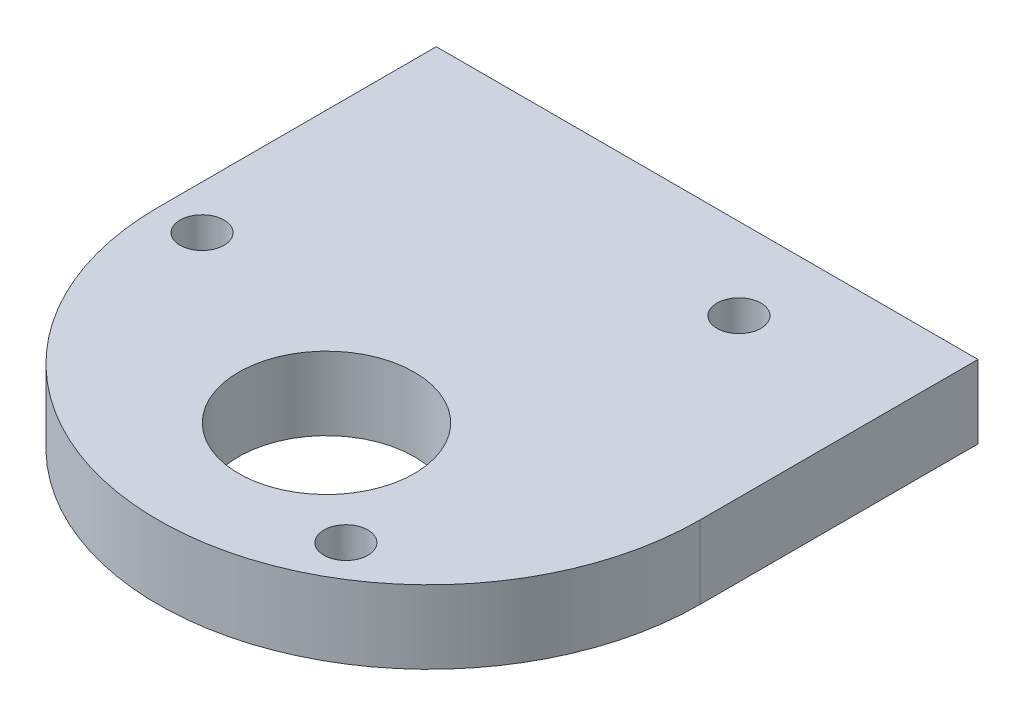
ISO-10303-21;
HEADER;
FILE_DESCRIPTION(('STEP AP214'),'2;1');
FILE_NAME('part.step','',(''),(''),'','','');
FILE_SCHEMA(('AUTOMOTIVE_DESIGN { 1 0 10303 214 1 1 1 1 }'));
ENDSEC;
DATA;
#1=APPLICATION_CONTEXT('core data for automotive mechanical design processes');
#2=APPLICATION_PROTOCOL_DEFINITION('international standard','automotive_design',2000,#1);
#3=PRODUCT_CONTEXT('',#1,'mechanical');
#4=PRODUCT('Part','Part','',(#3));
#5=PRODUCT_RELATED_PRODUCT_CATEGORY('part','',(#4));
#6=PRODUCT_DEFINITION_FORMATION('','',#4);
#7=PRODUCT_DEFINITION_CONTEXT('part definition',#1,'design');
#8=PRODUCT_DEFINITION('design','',#6,#7);
#9=PRODUCT_DEFINITION_SHAPE('','',#8);
#10=(LENGTH_UNIT() NAMED_UNIT(*) SI_UNIT(.MILLI.,.METRE.));
#11=(NAMED_UNIT(*) PLANE_ANGLE_UNIT() SI_UNIT($,.RADIAN.));
#12=(NAMED_UNIT(*) SI_UNIT($,.STERADIAN.) SOLID_ANGLE_UNIT());
#13=UNCERTAINTY_MEASURE_WITH_UNIT(LENGTH_MEASURE(1.E-05),#10,'distance_accuracy_value','');
#14=(GEOMETRIC_REPRESENTATION_CONTEXT(3) GLOBAL_UNCERTAINTY_ASSIGNED_CONTEXT((#13)) GLOBAL_UNIT_ASSIGNED_CONTEXT((#10,
#11,#12)) REPRESENTATION_CONTEXT('',''));
#15=CARTESIAN_POINT('',(0.,0.,0.));
#16=DIRECTION('',(0.,0.,1.));
#17=DIRECTION('',(1.,0.,0.));
#18=AXIS2_PLACEMENT_3D('',#15,#16,#17);
#19=CARTESIAN_POINT('',(-18.5,2.5,19.));
#20=DIRECTION('',(1.,0.,0.));
#21=DIRECTION('',(0.,0.,-1.));
#22=AXIS2_PLACEMENT_3D('',#19,#20,#21);
#23=PLANE('',#22);
#24=DIRECTION('',(0.,-1.,0.));
#25=VECTOR('',#24,1.);
#26=CARTESIAN_POINT('',(-18.5,2.5,0.));
#27=LINE('',#26,#25);
#28=CARTESIAN_POINT('',(-18.5,2.5,0.));
#29=VERTEX_POINT('',#28);
#30=CARTESIAN_POINT('',(-18.5,-2.5,0.));
#31=VERTEX_POINT('',#30);
#32=EDGE_CURVE('E137',#29,#31,#27,.T.);
#33=ORIENTED_EDGE('',*,*,#32,.T.);
#34=DIRECTION('',(0.,0.,-1.));
#35=VECTOR('',#34,1.);
#36=CARTESIAN_POINT('',(-18.5,-2.5,19.));
#37=LINE('',#36,#35);
#38=CARTESIAN_POINT('',(-18.5,-2.5,19.));
#39=VERTEX_POINT('',#38);
#40=EDGE_CURVE('E11',#39,#31,#37,.T.);
#41=ORIENTED_EDGE('',*,*,#40,.F.);
#42=DIRECTION('',(0.,-1.,0.));
#43=VECTOR('',#42,1.);
#44=CARTESIAN_POINT('',(-18.5,2.5,19.));
#45=LINE('',#44,#43);
#46=CARTESIAN_POINT('',(-18.5,2.5,19.));
#47=VERTEX_POINT('',#46);
#48=EDGE_CURVE('E140',#47,#39,#45,.T.);
#49=ORIENTED_EDGE('',*,*,#48,.F.);
#50=DIRECTION('',(0.,0.,-1.));
#51=VECTOR('',#50,1.);
#52=CARTESIAN_POINT('',(-18.5,2.5,19.));
#53=LINE('',#52,#51);
#54=EDGE_CURVE('E57',#47,#29,#53,.T.);
#55=ORIENTED_EDGE('',*,*,#54,.T.);
#56=EDGE_LOOP('',(#33,#41,#49,#55));
#57=FACE_BOUND('',#56,.T.);
#58=ADVANCED_FACE('F41',(#57),#23,.F.);
#59=CARTESIAN_POINT('',(-18.5,-2.5,19.));
#60=DIRECTION('',(0.,1.,0.));
#61=DIRECTION('',(0.,0.,1.));
#62=AXIS2_PLACEMENT_3D('',#59,#60,#61);
#63=PLANE('',#62);
#64=CARTESIAN_POINT('',(7.74999999999997,-2.5,5.57660624134118));
#65=DIRECTION('',(0.,-1.,0.));
#66=DIRECTION('',(0.,0.,-1.));
#67=AXIS2_PLACEMENT_3D('',#64,#65,#66);
#68=CIRCLE('',#67,1.5);
#69=CARTESIAN_POINT('',(7.74999999999997,-2.5,4.07660624134118));
#70=VERTEX_POINT('',#69);
#71=EDGE_CURVE('E110',#70,#70,#68,.T.);
#72=ORIENTED_EDGE('',*,*,#71,.F.);
#73=EDGE_LOOP('',(#72));
#74=FACE_BOUND('',#73,.T.);
#75=CARTESIAN_POINT('',(-15.5,-2.5,19.));
#76=DIRECTION('',(0.,-1.,0.));
#77=DIRECTION('',(0.,0.,-1.));
#78=AXIS2_PLACEMENT_3D('',#75,#76,#77);
#79=CIRCLE('',#78,1.5);
#80=CARTESIAN_POINT('',(-15.5,-2.5,17.5));
#81=VERTEX_POINT('',#80);
#82=EDGE_CURVE('E116',#81,#81,#79,.T.);
#83=ORIENTED_EDGE('',*,*,#82,.F.);
#84=EDGE_LOOP('',(#83));
#85=FACE_BOUND('',#84,.T.);
#86=CARTESIAN_POINT('',(7.74999999999997,-2.5,32.4233937586588));
#87=DIRECTION('',(0.,-1.,0.));
#88=DIRECTION('',(0.,0.,-1.));
#89=AXIS2_PLACEMENT_3D('',#86,#87,#88);
#90=CIRCLE('',#89,1.5);
#91=CARTESIAN_POINT('',(7.74999999999997,-2.5,30.9233937586588));
#92=VERTEX_POINT('',#91);
#93=EDGE_CURVE('E122',#92,#92,#90,.T.);
#94=ORIENTED_EDGE('',*,*,#93,.F.);
#95=EDGE_LOOP('',(#94));
#96=FACE_BOUND('',#95,.T.);
#97=CARTESIAN_POINT('',(0.,-2.5,26.));
#98=DIRECTION('',(0.,-1.,0.));
#99=DIRECTION('',(0.,0.,-1.));
#100=AXIS2_PLACEMENT_3D('',#97,#98,#99);
#101=CIRCLE('',#100,6.);
#102=CARTESIAN_POINT('',(0.,-2.5,20.));
#103=VERTEX_POINT('',#102);
#104=EDGE_CURVE('E125',#103,#103,#101,.T.);
#105=ORIENTED_EDGE('',*,*,#104,.F.);
#106=EDGE_LOOP('',(#105));
#107=FACE_BOUND('',#106,.T.);
#108=DIRECTION('',(0.,0.,-1.));
#109=VECTOR('',#108,1.);
#110=CARTESIAN_POINT('',(18.5,-2.5,19.));
#111=LINE('',#110,#109);
#112=CARTESIAN_POINT('',(18.5,-2.5,19.));
#113=VERTEX_POINT('',#112);
#114=CARTESIAN_POINT('',(18.5,-2.5,0.));
#115=VERTEX_POINT('',#114);
#116=EDGE_CURVE('E49',#113,#115,#111,.T.);
#117=ORIENTED_EDGE('',*,*,#116,.F.);
#118=CARTESIAN_POINT('',(0.,-2.5,19.));
#119=DIRECTION('',(0.,-1.,0.));
#120=DIRECTION('',(0.,0.,-1.));
#121=AXIS2_PLACEMENT_3D('',#118,#119,#120);
#122=CIRCLE('',#121,18.5);
#123=EDGE_CURVE('E131',#113,#39,#122,.T.);
#124=ORIENTED_EDGE('',*,*,#123,.T.);
#125=ORIENTED_EDGE('',*,*,#40,.T.);
#126=DIRECTION('',(1.,0.,0.));
#127=VECTOR('',#126,1.);
#128=CARTESIAN_POINT('',(-18.5,-2.5,0.));
#129=LINE('',#128,#127);
#130=EDGE_CURVE('E146',#31,#115,#129,.T.);
#131=ORIENTED_EDGE('',*,*,#130,.T.);
#132=EDGE_LOOP('',(#117,#124,#125,#131));
#133=FACE_BOUND('',#132,.T.);
#134=ADVANCED_FACE('F161',(#74,#85,#96,#107,#133),#63,.F.);
#135=CARTESIAN_POINT('',(18.5,2.5,19.));
#136=DIRECTION('',(1.,0.,0.));
#137=DIRECTION('',(0.,0.,-1.));
#138=AXIS2_PLACEMENT_3D('',#135,#136,#137);
#139=PLANE('',#138);
#140=DIRECTION('',(0.,-1.,0.));
#141=VECTOR('',#140,1.);
#142=CARTESIAN_POINT('',(18.5,2.5,0.));
#143=LINE('',#142,#141);
#144=CARTESIAN_POINT('',(18.5,2.5,0.));
#145=VERTEX_POINT('',#144);
#146=EDGE_CURVE('E149',#145,#115,#143,.T.);
#147=ORIENTED_EDGE('',*,*,#146,.F.);
#148=DIRECTION('',(0.,0.,-1.));
#149=VECTOR('',#148,1.);
#150=CARTESIAN_POINT('',(18.5,2.5,19.));
#151=LINE('',#150,#149);
#152=CARTESIAN_POINT('',(18.5,2.5,19.));
#153=VERTEX_POINT('',#152);
#154=EDGE_CURVE('E72',#153,#145,#151,.T.);
#155=ORIENTED_EDGE('',*,*,#154,.F.);
#156=DIRECTION('',(0.,-1.,0.));
#157=VECTOR('',#156,1.);
#158=CARTESIAN_POINT('',(18.5,2.5,19.));
#159=LINE('',#158,#157);
#160=EDGE_CURVE('E142',#153,#113,#159,.T.);
#161=ORIENTED_EDGE('',*,*,#160,.T.);
#162=ORIENTED_EDGE('',*,*,#116,.T.);
#163=EDGE_LOOP('',(#147,#155,#161,#162));
#164=FACE_BOUND('',#163,.T.);
#165=ADVANCED_FACE('F157',(#164),#139,.T.);
#166=CARTESIAN_POINT('',(-18.5,2.5,19.));
#167=DIRECTION('',(0.,1.,0.));
#168=DIRECTION('',(0.,0.,1.));
#169=AXIS2_PLACEMENT_3D('',#166,#167,#168);
#170=PLANE('',#169);
#171=CARTESIAN_POINT('',(7.74999999999997,2.5,5.57660624134118));
#172=DIRECTION('',(0.,-1.,0.));
#173=DIRECTION('',(0.,0.,-1.));
#174=AXIS2_PLACEMENT_3D('',#171,#172,#173);
#175=CIRCLE('',#174,1.5);
#176=CARTESIAN_POINT('',(7.74999999999997,2.5,4.07660624134118));
#177=VERTEX_POINT('',#176);
#178=EDGE_CURVE('E109',#177,#177,#175,.T.);
#179=ORIENTED_EDGE('',*,*,#178,.T.);
#180=EDGE_LOOP('',(#179));
#181=FACE_BOUND('',#180,.T.);
#182=CARTESIAN_POINT('',(-15.5,2.5,19.));
#183=DIRECTION('',(0.,-1.,0.));
#184=DIRECTION('',(0.,0.,-1.));
#185=AXIS2_PLACEMENT_3D('',#182,#183,#184);
#186=CIRCLE('',#185,1.5);
#187=CARTESIAN_POINT('',(-15.5,2.5,17.5));
#188=VERTEX_POINT('',#187);
#189=EDGE_CURVE('E113',#188,#188,#186,.T.);
#190=ORIENTED_EDGE('',*,*,#189,.T.);
#191=EDGE_LOOP('',(#190));
#192=FACE_BOUND('',#191,.T.);
#193=CARTESIAN_POINT('',(7.74999999999997,2.5,32.4233937586588));
#194=DIRECTION('',(0.,-1.,0.));
#195=DIRECTION('',(0.,0.,-1.));
#196=AXIS2_PLACEMENT_3D('',#193,#194,#195);
#197=CIRCLE('',#196,1.5);
#198=CARTESIAN_POINT('',(7.74999999999997,2.5,30.9233937586588));
#199=VERTEX_POINT('',#198);
#200=EDGE_CURVE('E119',#199,#199,#197,.T.);
#201=ORIENTED_EDGE('',*,*,#200,.T.);
#202=EDGE_LOOP('',(#201));
#203=FACE_BOUND('',#202,.T.);
#204=CARTESIAN_POINT('',(0.,2.5,26.));
#205=DIRECTION('',(0.,-1.,0.));
#206=DIRECTION('',(0.,0.,-1.));
#207=AXIS2_PLACEMENT_3D('',#204,#205,#206);
#208=CIRCLE('',#207,6.);
#209=CARTESIAN_POINT('',(0.,2.5,20.));
#210=VERTEX_POINT('',#209);
#211=EDGE_CURVE('E128',#210,#210,#208,.T.);
#212=ORIENTED_EDGE('',*,*,#211,.T.);
#213=EDGE_LOOP('',(#212));
#214=FACE_BOUND('',#213,.T.);
#215=ORIENTED_EDGE('',*,*,#54,.F.);
#216=CARTESIAN_POINT('',(0.,2.5,19.));
#217=DIRECTION('',(0.,-1.,0.));
#218=DIRECTION('',(0.,0.,-1.));
#219=AXIS2_PLACEMENT_3D('',#216,#217,#218);
#220=CIRCLE('',#219,18.5);
#221=EDGE_CURVE('E134',#153,#47,#220,.T.);
#222=ORIENTED_EDGE('',*,*,#221,.F.);
#223=ORIENTED_EDGE('',*,*,#154,.T.);
#224=DIRECTION('',(1.,0.,0.));
#225=VECTOR('',#224,1.);
#226=CARTESIAN_POINT('',(-18.5,2.5,0.));
#227=LINE('',#226,#225);
#228=EDGE_CURVE('E143',#29,#145,#227,.T.);
#229=ORIENTED_EDGE('',*,*,#228,.F.);
#230=EDGE_LOOP('',(#215,#222,#223,#229));
#231=FACE_BOUND('',#230,.T.);
#232=ADVANCED_FACE('F164',(#181,#192,#203,#214,#231),#170,.T.);
#233=CARTESIAN_POINT('',(0.,0.,0.));
#234=DIRECTION('',(0.,0.,1.));
#235=DIRECTION('',(1.,0.,0.));
#236=AXIS2_PLACEMENT_3D('',#233,#234,#235);
#237=PLANE('',#236);
#238=CARTESIAN_POINT('',(-15.,0.,0.));
#239=DIRECTION('',(0.,0.,-1.));
#240=DIRECTION('',(-1.,0.,0.));
#241=AXIS2_PLACEMENT_3D('',#238,#239,#240);
#242=CIRCLE('',#241,1.24999999999999);
#243=CARTESIAN_POINT('',(-16.25,0.,0.));
#244=VERTEX_POINT('',#243);
#245=EDGE_CURVE('E99',#244,#244,#242,.T.);
#246=ORIENTED_EDGE('',*,*,#245,.F.);
#247=EDGE_LOOP('',(#246));
#248=FACE_BOUND('',#247,.T.);
#249=CARTESIAN_POINT('',(15.,0.,0.));
#250=DIRECTION('',(0.,0.,-1.));
#251=DIRECTION('',(-1.,0.,0.));
#252=AXIS2_PLACEMENT_3D('',#249,#250,#251);
#253=CIRCLE('',#252,1.24999999999999);
#254=CARTESIAN_POINT('',(13.75,0.,0.));
#255=VERTEX_POINT('',#254);
#256=EDGE_CURVE('E98',#255,#255,#253,.T.);
#257=ORIENTED_EDGE('',*,*,#256,.F.);
#258=EDGE_LOOP('',(#257));
#259=FACE_BOUND('',#258,.T.);
#260=ORIENTED_EDGE('',*,*,#32,.F.);
#261=ORIENTED_EDGE('',*,*,#228,.T.);
#262=ORIENTED_EDGE('',*,*,#146,.T.);
#263=ORIENTED_EDGE('',*,*,#130,.F.);
#264=EDGE_LOOP('',(#260,#261,#262,#263));
#265=FACE_BOUND('',#264,.T.);
#266=ADVANCED_FACE('F163',(#248,#259,#265),#237,.F.);
#267=CARTESIAN_POINT('',(0.,2.5,19.));
#268=DIRECTION('',(0.,-1.,0.));
#269=DIRECTION('',(0.,0.,-1.));
#270=AXIS2_PLACEMENT_3D('',#267,#268,#269);
#271=CYLINDRICAL_SURFACE('',#270,18.5);
#272=ORIENTED_EDGE('',*,*,#221,.T.);
#273=ORIENTED_EDGE('',*,*,#48,.T.);
#274=ORIENTED_EDGE('',*,*,#123,.F.);
#275=ORIENTED_EDGE('',*,*,#160,.F.);
#276=EDGE_LOOP('',(#272,#273,#274,#275));
#277=FACE_BOUND('',#276,.T.);
#278=ADVANCED_FACE('F172',(#277),#271,.T.);
#279=CARTESIAN_POINT('',(0.,2.5,26.));
#280=DIRECTION('',(0.,-1.,0.));
#281=DIRECTION('',(0.,0.,-1.));
#282=AXIS2_PLACEMENT_3D('',#279,#280,#281);
#283=CYLINDRICAL_SURFACE('',#282,6.);
#284=ORIENTED_EDGE('',*,*,#211,.F.);
#285=EDGE_LOOP('',(#284));
#286=FACE_BOUND('',#285,.T.);
#287=ORIENTED_EDGE('',*,*,#104,.T.);
#288=EDGE_LOOP('',(#287));
#289=FACE_BOUND('',#288,.T.);
#290=ADVANCED_FACE('F192',(#286,#289),#283,.F.);
#291=CARTESIAN_POINT('',(7.74999999999997,2.5,32.4233937586588));
#292=DIRECTION('',(0.,-1.,0.));
#293=DIRECTION('',(0.,0.,-1.));
#294=AXIS2_PLACEMENT_3D('',#291,#292,#293);
#295=CYLINDRICAL_SURFACE('',#294,1.5);
#296=ORIENTED_EDGE('',*,*,#200,.F.);
#297=EDGE_LOOP('',(#296));
#298=FACE_BOUND('',#297,.T.);
#299=ORIENTED_EDGE('',*,*,#93,.T.);
#300=EDGE_LOOP('',(#299));
#301=FACE_BOUND('',#300,.T.);
#302=ADVANCED_FACE('F194',(#298,#301),#295,.F.);
#303=CARTESIAN_POINT('',(-15.5,2.5,19.));
#304=DIRECTION('',(0.,-1.,0.));
#305=DIRECTION('',(0.,0.,-1.));
#306=AXIS2_PLACEMENT_3D('',#303,#304,#305);
#307=CYLINDRICAL_SURFACE('',#306,1.5);
#308=ORIENTED_EDGE('',*,*,#189,.F.);
#309=EDGE_LOOP('',(#308));
#310=FACE_BOUND('',#309,.T.);
#311=ORIENTED_EDGE('',*,*,#82,.T.);
#312=EDGE_LOOP('',(#311));
#313=FACE_BOUND('',#312,.T.);
#314=ADVANCED_FACE('F201',(#310,#313),#307,.F.);
#315=CARTESIAN_POINT('',(7.74999999999997,2.5,5.57660624134118));
#316=DIRECTION('',(0.,-1.,0.));
#317=DIRECTION('',(0.,0.,-1.));
#318=AXIS2_PLACEMENT_3D('',#315,#316,#317);
#319=CYLINDRICAL_SURFACE('',#318,1.5);
#320=ORIENTED_EDGE('',*,*,#178,.F.);
#321=EDGE_LOOP('',(#320));
#322=FACE_BOUND('',#321,.T.);
#323=ORIENTED_EDGE('',*,*,#71,.T.);
#324=EDGE_LOOP('',(#323));
#325=FACE_BOUND('',#324,.T.);
#326=ADVANCED_FACE('F210',(#322,#325),#319,.F.);
#327=CARTESIAN_POINT('',(15.,0.,9.99999999999999));
#328=DIRECTION('',(0.,0.,-1.));
#329=DIRECTION('',(-1.,0.,0.));
#330=AXIS2_PLACEMENT_3D('',#327,#328,#329);
#331=CONICAL_SURFACE('',#330,1.24999999999999,1.02974425867665);
#332=CARTESIAN_POINT('',(15.,0.,10.7510757737844));
#333=VERTEX_POINT('',#332);
#334=VERTEX_LOOP('',#333);
#335=FACE_BOUND('',#334,.T.);
#336=CARTESIAN_POINT('',(15.,0.,9.99999999999999));
#337=DIRECTION('',(0.,0.,-1.));
#338=DIRECTION('',(-1.,0.,0.));
#339=AXIS2_PLACEMENT_3D('',#336,#337,#338);
#340=CIRCLE('',#339,1.24999999999999);
#341=CARTESIAN_POINT('',(13.75,0.,9.99999999999999));
#342=VERTEX_POINT('',#341);
#343=EDGE_CURVE('E102',#342,#342,#340,.T.);
#344=ORIENTED_EDGE('',*,*,#343,.T.);
#345=EDGE_LOOP('',(#344));
#346=FACE_BOUND('',#345,.T.);
#347=ADVANCED_FACE('F214',(#335,#346),#331,.F.);
#348=CARTESIAN_POINT('',(15.,0.,0.));
#349=DIRECTION('',(0.,0.,-1.));
#350=DIRECTION('',(-1.,0.,0.));
#351=AXIS2_PLACEMENT_3D('',#348,#349,#350);
#352=CYLINDRICAL_SURFACE('',#351,1.24999999999999);
#353=ORIENTED_EDGE('',*,*,#343,.F.);
#354=EDGE_LOOP('',(#353));
#355=FACE_BOUND('',#354,.T.);
#356=ORIENTED_EDGE('',*,*,#256,.T.);
#357=EDGE_LOOP('',(#356));
#358=FACE_BOUND('',#357,.T.);
#359=ADVANCED_FACE('F92',(#355,#358),#352,.F.);
#360=CARTESIAN_POINT('',(-15.,0.,9.99999999999999));
#361=DIRECTION('',(0.,0.,-1.));
#362=DIRECTION('',(-1.,0.,0.));
#363=AXIS2_PLACEMENT_3D('',#360,#361,#362);
#364=CONICAL_SURFACE('',#363,1.24999999999999,1.02974425867665);
#365=CARTESIAN_POINT('',(-15.,0.,10.7510757737844));
#366=VERTEX_POINT('',#365);
#367=VERTEX_LOOP('',#366);
#368=FACE_BOUND('',#367,.T.);
#369=CARTESIAN_POINT('',(-15.,0.,9.99999999999999));
#370=DIRECTION('',(0.,0.,-1.));
#371=DIRECTION('',(-1.,0.,0.));
#372=AXIS2_PLACEMENT_3D('',#369,#370,#371);
#373=CIRCLE('',#372,1.24999999999999);
#374=CARTESIAN_POINT('',(-16.25,0.,9.99999999999999));
#375=VERTEX_POINT('',#374);
#376=EDGE_CURVE('E96',#375,#375,#373,.T.);
#377=ORIENTED_EDGE('',*,*,#376,.T.);
#378=EDGE_LOOP('',(#377));
#379=FACE_BOUND('',#378,.T.);
#380=ADVANCED_FACE('F88',(#368,#379),#364,.F.);
#381=CARTESIAN_POINT('',(-15.,0.,0.));
#382=DIRECTION('',(0.,0.,-1.));
#383=DIRECTION('',(-1.,0.,0.));
#384=AXIS2_PLACEMENT_3D('',#381,#382,#383);
#385=CYLINDRICAL_SURFACE('',#384,1.24999999999999);
#386=ORIENTED_EDGE('',*,*,#376,.F.);
#387=EDGE_LOOP('',(#386));
#388=FACE_BOUND('',#387,.T.);
#389=ORIENTED_EDGE('',*,*,#245,.T.);
#390=EDGE_LOOP('',(#389));
#391=FACE_BOUND('',#390,.T.);
#392=ADVANCED_FACE('F91',(#388,#391),#385,.F.);
#393=CLOSED_SHELL('',(#58,#134,#165,#232,#266,#278,#290,#302,#314,#326,#347,#359,#380,#392));
#394=MANIFOLD_SOLID_BREP('B2',#393);
#395=ADVANCED_BREP_SHAPE_REPRESENTATION('',(#18,#394),#14);
#396=SHAPE_DEFINITION_REPRESENTATION(#9,#395);
ENDSEC;
END-ISO-10303-21;
